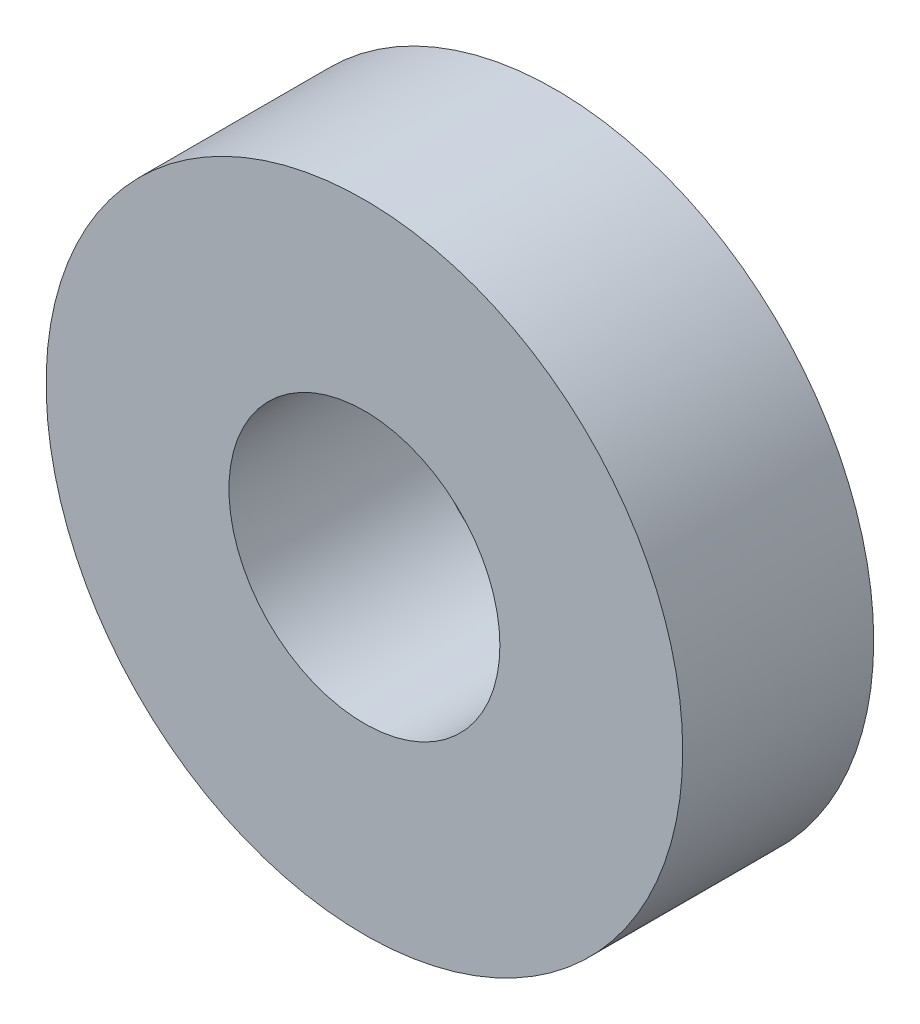
ISO-10303-21;
HEADER;
FILE_DESCRIPTION(('STEP AP214'),'2;1');
FILE_NAME('part.step','',(''),(''),'','','');
FILE_SCHEMA(('AUTOMOTIVE_DESIGN { 1 0 10303 214 1 1 1 1 }'));
ENDSEC;
DATA;
#1=APPLICATION_CONTEXT('core data for automotive mechanical design processes');
#2=APPLICATION_PROTOCOL_DEFINITION('international standard','automotive_design',2000,#1);
#3=PRODUCT_CONTEXT('',#1,'mechanical');
#4=PRODUCT('Part','Part','',(#3));
#5=PRODUCT_RELATED_PRODUCT_CATEGORY('part','',(#4));
#6=PRODUCT_DEFINITION_FORMATION('','',#4);
#7=PRODUCT_DEFINITION_CONTEXT('part definition',#1,'design');
#8=PRODUCT_DEFINITION('design','',#6,#7);
#9=PRODUCT_DEFINITION_SHAPE('','',#8);
#10=(LENGTH_UNIT() NAMED_UNIT(*) SI_UNIT(.MILLI.,.METRE.));
#11=(NAMED_UNIT(*) PLANE_ANGLE_UNIT() SI_UNIT($,.RADIAN.));
#12=(NAMED_UNIT(*) SI_UNIT($,.STERADIAN.) SOLID_ANGLE_UNIT());
#13=UNCERTAINTY_MEASURE_WITH_UNIT(LENGTH_MEASURE(1.E-05),#10,'distance_accuracy_value','');
#14=(GEOMETRIC_REPRESENTATION_CONTEXT(3) GLOBAL_UNCERTAINTY_ASSIGNED_CONTEXT((#13)) GLOBAL_UNIT_ASSIGNED_CONTEXT((#10,
#11,#12)) REPRESENTATION_CONTEXT('',''));
#15=CARTESIAN_POINT('',(0.,0.,0.));
#16=DIRECTION('',(0.,0.,1.));
#17=DIRECTION('',(1.,0.,0.));
#18=AXIS2_PLACEMENT_3D('',#15,#16,#17);
#19=CARTESIAN_POINT('',(0.,0.,2.38125));
#20=DIRECTION('',(0.,0.,-1.));
#21=DIRECTION('',(-1.,0.,0.));
#22=AXIS2_PLACEMENT_3D('',#19,#20,#21);
#23=CYLINDRICAL_SURFACE('',#22,7.9375);
#24=CARTESIAN_POINT('',(0.,0.,2.38125));
#25=DIRECTION('',(0.,0.,1.));
#26=DIRECTION('',(1.,0.,0.));
#27=AXIS2_PLACEMENT_3D('',#24,#25,#26);
#28=CIRCLE('',#27,7.9375);
#29=CARTESIAN_POINT('',(7.9375,0.,2.38125));
#30=VERTEX_POINT('',#29);
#31=EDGE_CURVE('E10',#30,#30,#28,.T.);
#32=ORIENTED_EDGE('',*,*,#31,.F.);
#33=EDGE_LOOP('',(#32));
#34=FACE_BOUND('',#33,.T.);
#35=CARTESIAN_POINT('',(0.,0.,-2.38125));
#36=DIRECTION('',(0.,0.,1.));
#37=DIRECTION('',(1.,0.,0.));
#38=AXIS2_PLACEMENT_3D('',#35,#36,#37);
#39=CIRCLE('',#38,7.9375);
#40=CARTESIAN_POINT('',(7.9375,0.,-2.38125));
#41=VERTEX_POINT('',#40);
#42=EDGE_CURVE('E33',#41,#41,#39,.T.);
#43=ORIENTED_EDGE('',*,*,#42,.T.);
#44=EDGE_LOOP('',(#43));
#45=FACE_BOUND('',#44,.T.);
#46=ADVANCED_FACE('F30',(#34,#45),#23,.T.);
#47=CARTESIAN_POINT('',(0.,0.,2.38125));
#48=DIRECTION('',(0.,0.,1.));
#49=DIRECTION('',(1.,0.,0.));
#50=AXIS2_PLACEMENT_3D('',#47,#48,#49);
#51=PLANE('',#50);
#52=CARTESIAN_POINT('',(0.,0.,2.38125));
#53=DIRECTION('',(0.,0.,1.));
#54=DIRECTION('',(1.,0.,0.));
#55=AXIS2_PLACEMENT_3D('',#52,#53,#54);
#56=CIRCLE('',#55,3.3782);
#57=CARTESIAN_POINT('',(3.3782,0.,2.38125));
#58=VERTEX_POINT('',#57);
#59=EDGE_CURVE('E44',#58,#58,#56,.T.);
#60=ORIENTED_EDGE('',*,*,#59,.F.);
#61=EDGE_LOOP('',(#60));
#62=FACE_BOUND('',#61,.T.);
#63=ORIENTED_EDGE('',*,*,#31,.T.);
#64=EDGE_LOOP('',(#63));
#65=FACE_BOUND('',#64,.T.);
#66=ADVANCED_FACE('F51',(#62,#65),#51,.T.);
#67=CARTESIAN_POINT('',(0.,0.,-2.38125));
#68=DIRECTION('',(0.,0.,1.));
#69=DIRECTION('',(1.,0.,0.));
#70=AXIS2_PLACEMENT_3D('',#67,#68,#69);
#71=PLANE('',#70);
#72=CARTESIAN_POINT('',(0.,0.,-2.38125));
#73=DIRECTION('',(0.,0.,1.));
#74=DIRECTION('',(1.,0.,0.));
#75=AXIS2_PLACEMENT_3D('',#72,#73,#74);
#76=CIRCLE('',#75,3.3782);
#77=CARTESIAN_POINT('',(3.3782,0.,-2.38125));
#78=VERTEX_POINT('',#77);
#79=EDGE_CURVE('E40',#78,#78,#76,.F.);
#80=ORIENTED_EDGE('',*,*,#79,.F.);
#81=EDGE_LOOP('',(#80));
#82=FACE_BOUND('',#81,.T.);
#83=ORIENTED_EDGE('',*,*,#42,.F.);
#84=EDGE_LOOP('',(#83));
#85=FACE_BOUND('',#84,.T.);
#86=ADVANCED_FACE('F53',(#82,#85),#71,.F.);
#87=CARTESIAN_POINT('',(0.,0.,-2.38225));
#88=DIRECTION('',(0.,0.,1.));
#89=DIRECTION('',(1.,0.,0.));
#90=AXIS2_PLACEMENT_3D('',#87,#88,#89);
#91=CYLINDRICAL_SURFACE('',#90,3.3782);
#92=ORIENTED_EDGE('',*,*,#59,.T.);
#93=EDGE_LOOP('',(#92));
#94=FACE_BOUND('',#93,.T.);
#95=ORIENTED_EDGE('',*,*,#79,.T.);
#96=EDGE_LOOP('',(#95));
#97=FACE_BOUND('',#96,.T.);
#98=ADVANCED_FACE('F48',(#94,#97),#91,.F.);
#99=CLOSED_SHELL('',(#46,#66,#86,#98));
#100=MANIFOLD_SOLID_BREP('B2',#99);
#101=ADVANCED_BREP_SHAPE_REPRESENTATION('',(#18,#100),#14);
#102=SHAPE_DEFINITION_REPRESENTATION(#9,#101);
ENDSEC;
END-ISO-10303-21;
